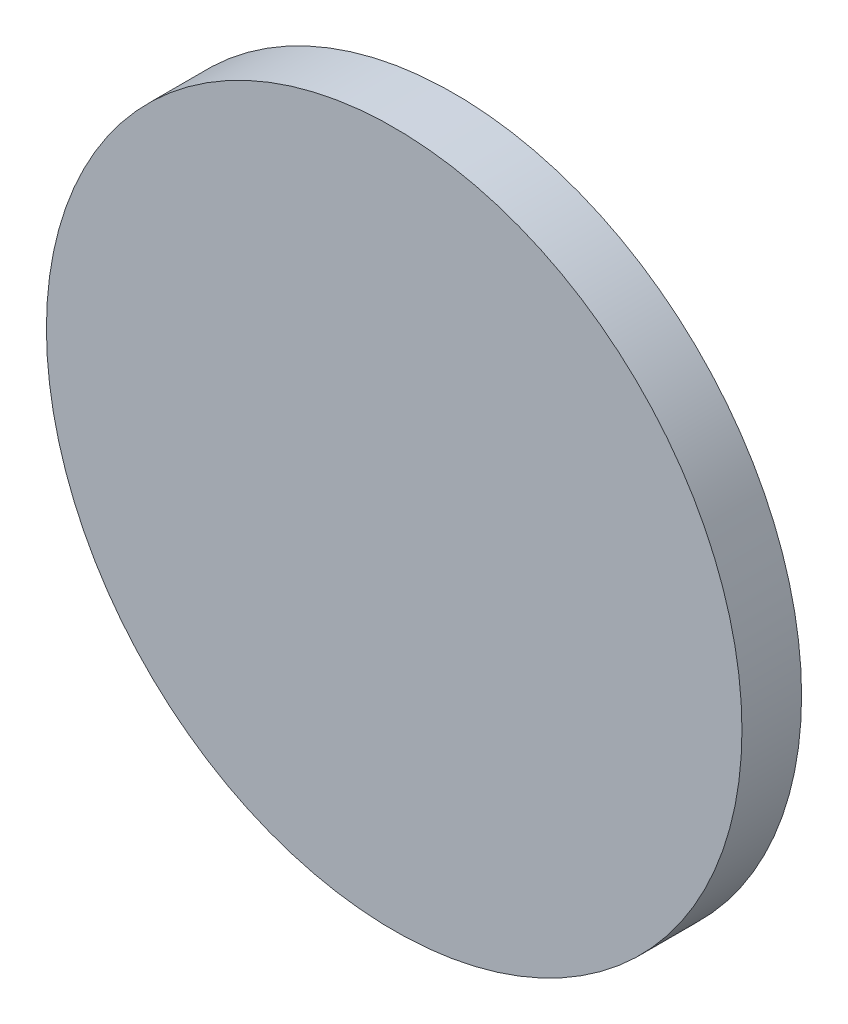
ISO-10303-21;
HEADER;
FILE_DESCRIPTION(('STEP AP214'),'2;1');
FILE_NAME('part.step','',(''),(''),'','','');
FILE_SCHEMA(('AUTOMOTIVE_DESIGN { 1 0 10303 214 1 1 1 1 }'));
ENDSEC;
DATA;
#1=APPLICATION_CONTEXT('core data for automotive mechanical design processes');
#2=APPLICATION_PROTOCOL_DEFINITION('international standard','automotive_design',2000,#1);
#3=PRODUCT_CONTEXT('',#1,'mechanical');
#4=PRODUCT('Part','Part','',(#3));
#5=PRODUCT_RELATED_PRODUCT_CATEGORY('part','',(#4));
#6=PRODUCT_DEFINITION_FORMATION('','',#4);
#7=PRODUCT_DEFINITION_CONTEXT('part definition',#1,'design');
#8=PRODUCT_DEFINITION('design','',#6,#7);
#9=PRODUCT_DEFINITION_SHAPE('','',#8);
#10=(LENGTH_UNIT() NAMED_UNIT(*) SI_UNIT(.MILLI.,.METRE.));
#11=(NAMED_UNIT(*) PLANE_ANGLE_UNIT() SI_UNIT($,.RADIAN.));
#12=(NAMED_UNIT(*) SI_UNIT($,.STERADIAN.) SOLID_ANGLE_UNIT());
#13=UNCERTAINTY_MEASURE_WITH_UNIT(LENGTH_MEASURE(1.E-05),#10,'distance_accuracy_value','');
#14=(GEOMETRIC_REPRESENTATION_CONTEXT(3) GLOBAL_UNCERTAINTY_ASSIGNED_CONTEXT((#13)) GLOBAL_UNIT_ASSIGNED_CONTEXT((#10,
#11,#12)) REPRESENTATION_CONTEXT('',''));
#15=CARTESIAN_POINT('',(0.,0.,0.));
#16=DIRECTION('',(0.,0.,1.));
#17=DIRECTION('',(1.,0.,0.));
#18=AXIS2_PLACEMENT_3D('',#15,#16,#17);
#19=CARTESIAN_POINT('',(10.33996,5.905500014875,0.79916));
#20=DIRECTION('',(0.,0.,1.));
#21=DIRECTION('',(1.,0.,0.));
#22=AXIS2_PLACEMENT_3D('',#19,#20,#21);
#23=PLANE('',#22);
#24=CARTESIAN_POINT('',(10.33996,5.905500014875,0.79916));
#25=DIRECTION('',(0.,0.,1.));
#26=DIRECTION('',(1.,0.,0.));
#27=AXIS2_PLACEMENT_3D('',#24,#25,#26);
#28=CIRCLE('',#27,0.200024667);
#29=CARTESIAN_POINT('',(10.539984667,5.905500014875,0.79916));
#30=VERTEX_POINT('',#29);
#31=EDGE_CURVE('E18',#30,#30,#28,.F.);
#32=ORIENTED_EDGE('',*,*,#31,.F.);
#33=EDGE_LOOP('',(#32));
#34=FACE_BOUND('',#33,.T.);
#35=ADVANCED_FACE('F15',(#34),#23,.T.);
#36=CARTESIAN_POINT('',(10.33996,5.905500014875,0.76487));
#37=DIRECTION('',(0.,0.,1.));
#38=DIRECTION('',(1.,0.,0.));
#39=AXIS2_PLACEMENT_3D('',#36,#37,#38);
#40=CYLINDRICAL_SURFACE('',#39,0.200024667);
#41=ORIENTED_EDGE('',*,*,#31,.T.);
#42=EDGE_LOOP('',(#41));
#43=FACE_BOUND('',#42,.T.);
#44=CARTESIAN_POINT('',(10.33996,5.905500014875,0.76487));
#45=DIRECTION('',(0.,0.,1.));
#46=DIRECTION('',(1.,0.,0.));
#47=AXIS2_PLACEMENT_3D('',#44,#45,#46);
#48=CIRCLE('',#47,0.200024667);
#49=CARTESIAN_POINT('',(10.539984667,5.905500014875,0.76487));
#50=VERTEX_POINT('',#49);
#51=EDGE_CURVE('E10',#50,#50,#48,.F.);
#52=ORIENTED_EDGE('',*,*,#51,.F.);
#53=EDGE_LOOP('',(#52));
#54=FACE_BOUND('',#53,.T.);
#55=ADVANCED_FACE('F27',(#43,#54),#40,.T.);
#56=CARTESIAN_POINT('',(10.33996,5.905500014875,0.76487));
#57=DIRECTION('',(0.,0.,-1.));
#58=DIRECTION('',(-1.,0.,0.));
#59=AXIS2_PLACEMENT_3D('',#56,#57,#58);
#60=PLANE('',#59);
#61=ORIENTED_EDGE('',*,*,#51,.T.);
#62=EDGE_LOOP('',(#61));
#63=FACE_BOUND('',#62,.T.);
#64=ADVANCED_FACE('F35',(#63),#60,.T.);
#65=CLOSED_SHELL('',(#35,#55,#64));
#66=MANIFOLD_SOLID_BREP('B1',#65);
#67=ADVANCED_BREP_SHAPE_REPRESENTATION('',(#18,#66),#14);
#68=SHAPE_DEFINITION_REPRESENTATION(#9,#67);
ENDSEC;
END-ISO-10303-21;
